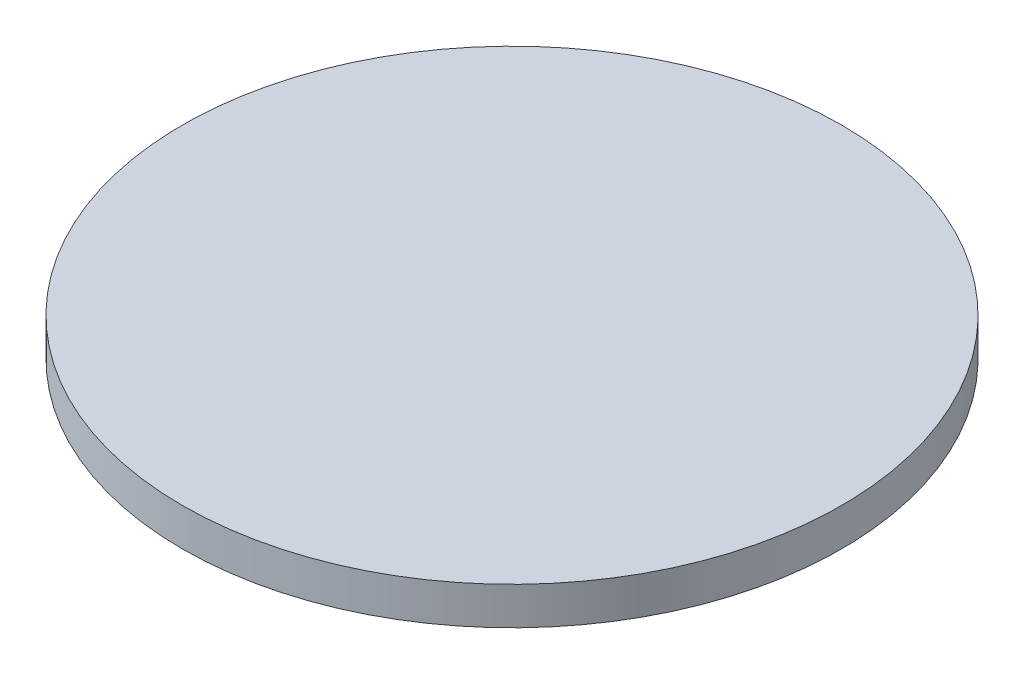
ISO-10303-21;
HEADER;
FILE_DESCRIPTION(('STEP AP214'),'2;1');
FILE_NAME('part.step','',(''),(''),'','','');
FILE_SCHEMA(('AUTOMOTIVE_DESIGN { 1 0 10303 214 1 1 1 1 }'));
ENDSEC;
DATA;
#1=APPLICATION_CONTEXT('core data for automotive mechanical design processes');
#2=APPLICATION_PROTOCOL_DEFINITION('international standard','automotive_design',2000,#1);
#3=PRODUCT_CONTEXT('',#1,'mechanical');
#4=PRODUCT('Part','Part','',(#3));
#5=PRODUCT_RELATED_PRODUCT_CATEGORY('part','',(#4));
#6=PRODUCT_DEFINITION_FORMATION('','',#4);
#7=PRODUCT_DEFINITION_CONTEXT('part definition',#1,'design');
#8=PRODUCT_DEFINITION('design','',#6,#7);
#9=PRODUCT_DEFINITION_SHAPE('','',#8);
#10=(LENGTH_UNIT() NAMED_UNIT(*) SI_UNIT(.MILLI.,.METRE.));
#11=(NAMED_UNIT(*) PLANE_ANGLE_UNIT() SI_UNIT($,.RADIAN.));
#12=(NAMED_UNIT(*) SI_UNIT($,.STERADIAN.) SOLID_ANGLE_UNIT());
#13=UNCERTAINTY_MEASURE_WITH_UNIT(LENGTH_MEASURE(1.E-05),#10,'distance_accuracy_value','');
#14=(GEOMETRIC_REPRESENTATION_CONTEXT(3) GLOBAL_UNCERTAINTY_ASSIGNED_CONTEXT((#13)) GLOBAL_UNIT_ASSIGNED_CONTEXT((#10,
#11,#12)) REPRESENTATION_CONTEXT('',''));
#15=CARTESIAN_POINT('',(0.,0.,0.));
#16=DIRECTION('',(0.,0.,1.));
#17=DIRECTION('',(1.,0.,0.));
#18=AXIS2_PLACEMENT_3D('',#15,#16,#17);
#19=CARTESIAN_POINT('',(0.,20.,0.));
#20=DIRECTION('',(0.,-1.,0.));
#21=DIRECTION('',(0.,0.,-1.));
#22=AXIS2_PLACEMENT_3D('',#19,#20,#21);
#23=CYLINDRICAL_SURFACE('',#22,175.);
#24=CARTESIAN_POINT('',(0.,20.,0.));
#25=DIRECTION('',(0.,1.,0.));
#26=DIRECTION('',(0.,0.,1.));
#27=AXIS2_PLACEMENT_3D('',#24,#25,#26);
#28=CIRCLE('',#27,175.);
#29=CARTESIAN_POINT('',(0.,20.,175.));
#30=VERTEX_POINT('',#29);
#31=EDGE_CURVE('E10',#30,#30,#28,.T.);
#32=ORIENTED_EDGE('',*,*,#31,.F.);
#33=EDGE_LOOP('',(#32));
#34=FACE_BOUND('',#33,.T.);
#35=CARTESIAN_POINT('',(0.,0.,0.));
#36=DIRECTION('',(0.,1.,0.));
#37=DIRECTION('',(0.,0.,1.));
#38=AXIS2_PLACEMENT_3D('',#35,#36,#37);
#39=CIRCLE('',#38,175.);
#40=CARTESIAN_POINT('',(0.,0.,175.));
#41=VERTEX_POINT('',#40);
#42=EDGE_CURVE('E34',#41,#41,#39,.T.);
#43=ORIENTED_EDGE('',*,*,#42,.T.);
#44=EDGE_LOOP('',(#43));
#45=FACE_BOUND('',#44,.T.);
#46=ADVANCED_FACE('F31',(#34,#45),#23,.T.);
#47=CARTESIAN_POINT('',(0.,20.,0.));
#48=DIRECTION('',(0.,1.,0.));
#49=DIRECTION('',(0.,0.,1.));
#50=AXIS2_PLACEMENT_3D('',#47,#48,#49);
#51=PLANE('',#50);
#52=ORIENTED_EDGE('',*,*,#31,.T.);
#53=EDGE_LOOP('',(#52));
#54=FACE_BOUND('',#53,.T.);
#55=ADVANCED_FACE('F60',(#54),#51,.T.);
#56=CARTESIAN_POINT('',(0.,0.,0.));
#57=DIRECTION('',(0.,1.,0.));
#58=DIRECTION('',(0.,0.,1.));
#59=AXIS2_PLACEMENT_3D('',#56,#57,#58);
#60=PLANE('',#59);
#61=CARTESIAN_POINT('',(0.,0.,0.));
#62=DIRECTION('',(0.,-1.,0.));
#63=DIRECTION('',(0.,0.,-1.));
#64=AXIS2_PLACEMENT_3D('',#61,#62,#63);
#65=CIRCLE('',#64,70.);
#66=CARTESIAN_POINT('',(0.,0.,-70.));
#67=VERTEX_POINT('',#66);
#68=EDGE_CURVE('E43',#67,#67,#65,.T.);
#69=ORIENTED_EDGE('',*,*,#68,.F.);
#70=EDGE_LOOP('',(#69));
#71=FACE_BOUND('',#70,.T.);
#72=ORIENTED_EDGE('',*,*,#42,.F.);
#73=EDGE_LOOP('',(#72));
#74=FACE_BOUND('',#73,.T.);
#75=ADVANCED_FACE('F54',(#71,#74),#60,.F.);
#76=CARTESIAN_POINT('',(0.,10.,0.));
#77=DIRECTION('',(0.,-1.,0.));
#78=DIRECTION('',(0.,0.,-1.));
#79=AXIS2_PLACEMENT_3D('',#76,#77,#78);
#80=CYLINDRICAL_SURFACE('',#79,70.);
#81=CARTESIAN_POINT('',(0.,10.,0.));
#82=DIRECTION('',(0.,-1.,0.));
#83=DIRECTION('',(0.,0.,-1.));
#84=AXIS2_PLACEMENT_3D('',#81,#82,#83);
#85=CIRCLE('',#84,70.);
#86=CARTESIAN_POINT('',(0.,10.,-70.));
#87=VERTEX_POINT('',#86);
#88=EDGE_CURVE('E41',#87,#87,#85,.T.);
#89=ORIENTED_EDGE('',*,*,#88,.F.);
#90=EDGE_LOOP('',(#89));
#91=FACE_BOUND('',#90,.T.);
#92=ORIENTED_EDGE('',*,*,#68,.T.);
#93=EDGE_LOOP('',(#92));
#94=FACE_BOUND('',#93,.T.);
#95=ADVANCED_FACE('F51',(#91,#94),#80,.F.);
#96=CARTESIAN_POINT('',(0.,10.,0.));
#97=DIRECTION('',(0.,-1.,0.));
#98=DIRECTION('',(0.,0.,-1.));
#99=AXIS2_PLACEMENT_3D('',#96,#97,#98);
#100=PLANE('',#99);
#101=ORIENTED_EDGE('',*,*,#88,.T.);
#102=EDGE_LOOP('',(#101));
#103=FACE_BOUND('',#102,.T.);
#104=ADVANCED_FACE('F49',(#103),#100,.T.);
#105=CLOSED_SHELL('',(#46,#55,#75,#95,#104));
#106=MANIFOLD_SOLID_BREP('B2',#105);
#107=ADVANCED_BREP_SHAPE_REPRESENTATION('',(#18,#106),#14);
#108=SHAPE_DEFINITION_REPRESENTATION(#9,#107);
ENDSEC;
END-ISO-10303-21;
